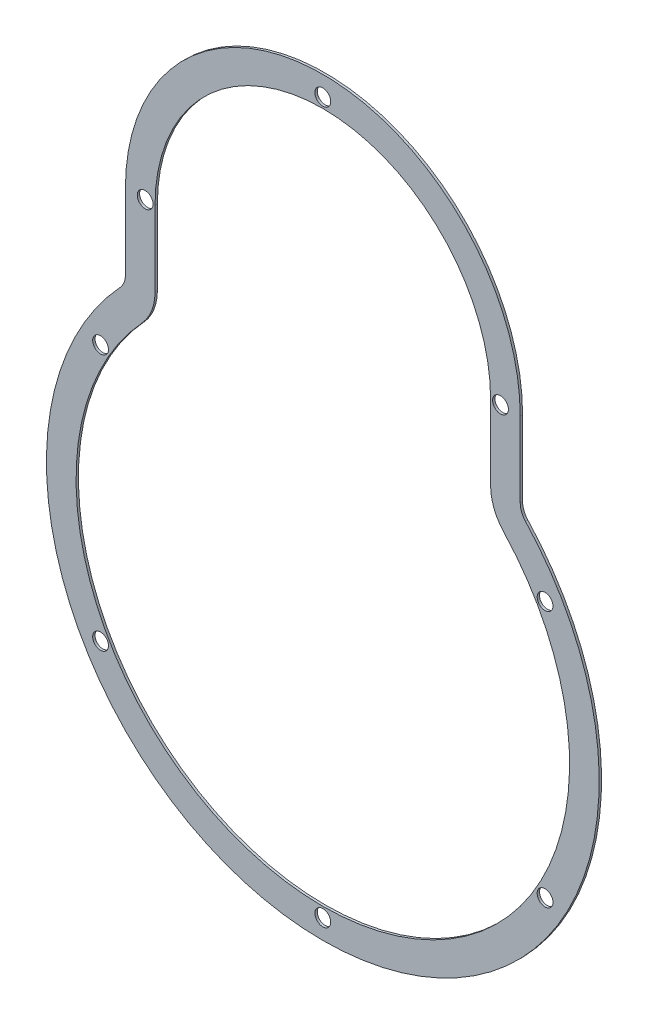
ISO-10303-21;
HEADER;
FILE_DESCRIPTION(('STEP AP214'),'2;1');
FILE_NAME('part.step','',(''),(''),'','','');
FILE_SCHEMA(('AUTOMOTIVE_DESIGN { 1 0 10303 214 1 1 1 1 }'));
ENDSEC;
DATA;
#1=APPLICATION_CONTEXT('core data for automotive mechanical design processes');
#2=APPLICATION_PROTOCOL_DEFINITION('international standard','automotive_design',2000,#1);
#3=PRODUCT_CONTEXT('',#1,'mechanical');
#4=PRODUCT('Part','Part','',(#3));
#5=PRODUCT_RELATED_PRODUCT_CATEGORY('part','',(#4));
#6=PRODUCT_DEFINITION_FORMATION('','',#4);
#7=PRODUCT_DEFINITION_CONTEXT('part definition',#1,'design');
#8=PRODUCT_DEFINITION('design','',#6,#7);
#9=PRODUCT_DEFINITION_SHAPE('','',#8);
#10=(LENGTH_UNIT() NAMED_UNIT(*) SI_UNIT(.MILLI.,.METRE.));
#11=(NAMED_UNIT(*) PLANE_ANGLE_UNIT() SI_UNIT($,.RADIAN.));
#12=(NAMED_UNIT(*) SI_UNIT($,.STERADIAN.) SOLID_ANGLE_UNIT());
#13=UNCERTAINTY_MEASURE_WITH_UNIT(LENGTH_MEASURE(1.E-05),#10,'distance_accuracy_value','');
#14=(GEOMETRIC_REPRESENTATION_CONTEXT(3) GLOBAL_UNCERTAINTY_ASSIGNED_CONTEXT((#13)) GLOBAL_UNIT_ASSIGNED_CONTEXT((#10,
#11,#12)) REPRESENTATION_CONTEXT('',''));
#15=CARTESIAN_POINT('',(0.,0.,0.));
#16=DIRECTION('',(0.,0.,1.));
#17=DIRECTION('',(1.,0.,0.));
#18=AXIS2_PLACEMENT_3D('',#15,#16,#17);
#19=CARTESIAN_POINT('',(0.,88.9,0.762));
#20=DIRECTION('',(0.,0.,1.));
#21=DIRECTION('',(1.,0.,0.));
#22=AXIS2_PLACEMENT_3D('',#19,#20,#21);
#23=PLANE('',#22);
#24=CARTESIAN_POINT('',(71.4903970824055,-41.2749999999998,0.762));
#25=DIRECTION('',(0.,0.,1.));
#26=DIRECTION('',(1.,0.,0.));
#27=AXIS2_PLACEMENT_3D('',#24,#25,#26);
#28=CIRCLE('',#27,2.54);
#29=CARTESIAN_POINT('',(74.0303970824055,-41.2749999999998,0.762));
#30=VERTEX_POINT('',#29);
#31=EDGE_CURVE('E326',#30,#30,#28,.T.);
#32=ORIENTED_EDGE('',*,*,#31,.F.);
#33=EDGE_LOOP('',(#32));
#34=FACE_BOUND('',#33,.T.);
#35=CARTESIAN_POINT('',(57.15,88.9000000000006,0.762));
#36=DIRECTION('',(0.,0.,1.));
#37=DIRECTION('',(1.,0.,0.));
#38=AXIS2_PLACEMENT_3D('',#35,#36,#37);
#39=CIRCLE('',#38,2.54);
#40=CARTESIAN_POINT('',(59.69,88.9000000000006,0.762));
#41=VERTEX_POINT('',#40);
#42=EDGE_CURVE('E338',#41,#41,#39,.T.);
#43=ORIENTED_EDGE('',*,*,#42,.F.);
#44=EDGE_LOOP('',(#43));
#45=FACE_BOUND('',#44,.T.);
#46=CARTESIAN_POINT('',(-57.15,88.8999999999998,0.762));
#47=DIRECTION('',(0.,0.,1.));
#48=DIRECTION('',(1.,0.,0.));
#49=AXIS2_PLACEMENT_3D('',#46,#47,#48);
#50=CIRCLE('',#49,2.54);
#51=CARTESIAN_POINT('',(-54.61,88.8999999999998,0.762));
#52=VERTEX_POINT('',#51);
#53=EDGE_CURVE('E350',#52,#52,#50,.T.);
#54=ORIENTED_EDGE('',*,*,#53,.F.);
#55=EDGE_LOOP('',(#54));
#56=FACE_BOUND('',#55,.T.);
#57=CARTESIAN_POINT('',(-71.4903970824049,-41.2750000000008,0.762));
#58=DIRECTION('',(0.,0.,1.));
#59=DIRECTION('',(1.,0.,0.));
#60=AXIS2_PLACEMENT_3D('',#57,#58,#59);
#61=CIRCLE('',#60,2.54);
#62=CARTESIAN_POINT('',(-68.9503970824049,-41.2750000000008,0.762));
#63=VERTEX_POINT('',#62);
#64=EDGE_CURVE('E158',#63,#63,#61,.T.);
#65=ORIENTED_EDGE('',*,*,#64,.F.);
#66=EDGE_LOOP('',(#65));
#67=FACE_BOUND('',#66,.T.);
#68=CARTESIAN_POINT('',(0.,88.9,0.762));
#69=DIRECTION('',(0.,0.,1.));
#70=DIRECTION('',(1.,0.,0.));
#71=AXIS2_PLACEMENT_3D('',#68,#69,#70);
#72=CIRCLE('',#71,63.5);
#73=CARTESIAN_POINT('',(63.5,88.9,0.762));
#74=VERTEX_POINT('',#73);
#75=CARTESIAN_POINT('',(-63.5,88.9,0.762));
#76=VERTEX_POINT('',#75);
#77=EDGE_CURVE('E178',#74,#76,#72,.T.);
#78=ORIENTED_EDGE('',*,*,#77,.T.);
#79=DIRECTION('',(0.,-1.,0.));
#80=VECTOR('',#79,1.);
#81=CARTESIAN_POINT('',(-63.5,88.9,0.762));
#82=LINE('',#81,#80);
#83=CARTESIAN_POINT('',(-63.5,64.7575478226284,0.762));
#84=VERTEX_POINT('',#83);
#85=EDGE_CURVE('E181',#76,#84,#82,.T.);
#86=ORIENTED_EDGE('',*,*,#85,.T.);
#87=CARTESIAN_POINT('',(-69.85,64.7575478226284,0.762));
#88=DIRECTION('',(0.,0.,-1.));
#89=DIRECTION('',(1.,0.,0.));
#90=AXIS2_PLACEMENT_3D('',#87,#88,#89);
#91=CIRCLE('',#90,6.34999999999999);
#92=CARTESIAN_POINT('',(-65.1933333333333,60.4403779677865,0.762));
#93=VERTEX_POINT('',#92);
#94=EDGE_CURVE('E184',#84,#93,#91,.T.);
#95=ORIENTED_EDGE('',*,*,#94,.T.);
#96=CARTESIAN_POINT('',(0.,0.,0.762));
#97=DIRECTION('',(0.,0.,1.));
#98=DIRECTION('',(1.,0.,0.));
#99=AXIS2_PLACEMENT_3D('',#96,#97,#98);
#100=CIRCLE('',#99,88.9);
#101=CARTESIAN_POINT('',(65.1933333333333,60.4403779677865,0.762));
#102=VERTEX_POINT('',#101);
#103=EDGE_CURVE('E186',#93,#102,#100,.T.);
#104=ORIENTED_EDGE('',*,*,#103,.T.);
#105=CARTESIAN_POINT('',(69.85,64.7575478226284,0.762));
#106=DIRECTION('',(0.,0.,-1.));
#107=DIRECTION('',(1.,0.,0.));
#108=AXIS2_PLACEMENT_3D('',#105,#106,#107);
#109=CIRCLE('',#108,6.35);
#110=CARTESIAN_POINT('',(63.5,64.7575478226284,0.762));
#111=VERTEX_POINT('',#110);
#112=EDGE_CURVE('E188',#102,#111,#109,.T.);
#113=ORIENTED_EDGE('',*,*,#112,.T.);
#114=DIRECTION('',(0.,1.,0.));
#115=VECTOR('',#114,1.);
#116=CARTESIAN_POINT('',(63.5,64.7575478226284,0.762));
#117=LINE('',#116,#115);
#118=EDGE_CURVE('E190',#111,#74,#117,.T.);
#119=ORIENTED_EDGE('',*,*,#118,.T.);
#120=EDGE_LOOP('',(#78,#86,#95,#104,#113,#119));
#121=FACE_BOUND('',#120,.T.);
#122=DIRECTION('',(0.,-1.,0.));
#123=VECTOR('',#122,1.);
#124=CARTESIAN_POINT('',(-53.975,88.9,0.762));
#125=LINE('',#124,#123);
#126=CARTESIAN_POINT('',(-53.975,88.9,0.762));
#127=VERTEX_POINT('',#126);
#128=CARTESIAN_POINT('',(-53.975,64.7575478226284,0.762));
#129=VERTEX_POINT('',#128);
#130=EDGE_CURVE('E132',#127,#129,#125,.T.);
#131=ORIENTED_EDGE('',*,*,#130,.F.);
#132=CARTESIAN_POINT('',(0.,88.9,0.762));
#133=DIRECTION('',(0.,0.,1.));
#134=DIRECTION('',(1.,0.,0.));
#135=AXIS2_PLACEMENT_3D('',#132,#133,#134);
#136=CIRCLE('',#135,53.975);
#137=CARTESIAN_POINT('',(53.975,88.9,0.762));
#138=VERTEX_POINT('',#137);
#139=EDGE_CURVE('E124',#138,#127,#136,.T.);
#140=ORIENTED_EDGE('',*,*,#139,.F.);
#141=DIRECTION('',(0.,1.,0.));
#142=VECTOR('',#141,1.);
#143=CARTESIAN_POINT('',(53.975,64.7575478226284,0.762));
#144=LINE('',#143,#142);
#145=CARTESIAN_POINT('',(53.975,64.7575478226284,0.762));
#146=VERTEX_POINT('',#145);
#147=EDGE_CURVE('E155',#146,#138,#144,.T.);
#148=ORIENTED_EDGE('',*,*,#147,.F.);
#149=CARTESIAN_POINT('',(69.85,64.7575478226284,0.762));
#150=DIRECTION('',(0.,0.,-1.));
#151=DIRECTION('',(1.,0.,0.));
#152=AXIS2_PLACEMENT_3D('',#149,#150,#151);
#153=CIRCLE('',#152,15.875);
#154=CARTESIAN_POINT('',(58.2083333333333,53.9646231855236,0.762));
#155=VERTEX_POINT('',#154);
#156=EDGE_CURVE('E153',#155,#146,#153,.T.);
#157=ORIENTED_EDGE('',*,*,#156,.F.);
#158=CARTESIAN_POINT('',(0.,0.,0.762));
#159=DIRECTION('',(0.,0.,1.));
#160=DIRECTION('',(1.,0.,0.));
#161=AXIS2_PLACEMENT_3D('',#158,#159,#160);
#162=CIRCLE('',#161,79.375);
#163=CARTESIAN_POINT('',(-58.2083333333333,53.9646231855236,0.762));
#164=VERTEX_POINT('',#163);
#165=EDGE_CURVE('E148',#164,#155,#162,.T.);
#166=ORIENTED_EDGE('',*,*,#165,.F.);
#167=CARTESIAN_POINT('',(-69.85,64.7575478226284,0.762));
#168=DIRECTION('',(0.,0.,-1.));
#169=DIRECTION('',(1.,0.,0.));
#170=AXIS2_PLACEMENT_3D('',#167,#168,#169);
#171=CIRCLE('',#170,15.875);
#172=EDGE_CURVE('E146',#129,#164,#171,.T.);
#173=ORIENTED_EDGE('',*,*,#172,.F.);
#174=EDGE_LOOP('',(#131,#140,#148,#157,#166,#173));
#175=FACE_BOUND('',#174,.T.);
#176=CARTESIAN_POINT('',(-71.4903970824058,41.2749999999993,0.762));
#177=DIRECTION('',(0.,0.,1.));
#178=DIRECTION('',(1.,0.,0.));
#179=AXIS2_PLACEMENT_3D('',#176,#177,#178);
#180=CIRCLE('',#179,2.54);
#181=CARTESIAN_POINT('',(-68.9503970824058,41.2749999999993,0.762));
#182=VERTEX_POINT('',#181);
#183=EDGE_CURVE('E356',#182,#182,#180,.T.);
#184=ORIENTED_EDGE('',*,*,#183,.F.);
#185=EDGE_LOOP('',(#184));
#186=FACE_BOUND('',#185,.T.);
#187=CARTESIAN_POINT('',(0.,146.05,0.762));
#188=DIRECTION('',(0.,0.,1.));
#189=DIRECTION('',(1.,0.,0.));
#190=AXIS2_PLACEMENT_3D('',#187,#188,#189);
#191=CIRCLE('',#190,2.54);
#192=CARTESIAN_POINT('',(2.54,146.05,0.762));
#193=VERTEX_POINT('',#192);
#194=EDGE_CURVE('E344',#193,#193,#191,.T.);
#195=ORIENTED_EDGE('',*,*,#194,.F.);
#196=EDGE_LOOP('',(#195));
#197=FACE_BOUND('',#196,.T.);
#198=CARTESIAN_POINT('',(71.4903970824052,41.2750000000003,0.762));
#199=DIRECTION('',(0.,0.,1.));
#200=DIRECTION('',(1.,0.,0.));
#201=AXIS2_PLACEMENT_3D('',#198,#199,#200);
#202=CIRCLE('',#201,2.54);
#203=CARTESIAN_POINT('',(74.0303970824052,41.2750000000003,0.762));
#204=VERTEX_POINT('',#203);
#205=EDGE_CURVE('E332',#204,#204,#202,.T.);
#206=ORIENTED_EDGE('',*,*,#205,.F.);
#207=EDGE_LOOP('',(#206));
#208=FACE_BOUND('',#207,.T.);
#209=CARTESIAN_POINT('',(0.,-82.55,0.762));
#210=DIRECTION('',(0.,0.,1.));
#211=DIRECTION('',(1.,0.,0.));
#212=AXIS2_PLACEMENT_3D('',#209,#210,#211);
#213=CIRCLE('',#212,2.54);
#214=CARTESIAN_POINT('',(2.54,-82.55,0.762));
#215=VERTEX_POINT('',#214);
#216=EDGE_CURVE('E317',#215,#215,#213,.T.);
#217=ORIENTED_EDGE('',*,*,#216,.F.);
#218=EDGE_LOOP('',(#217));
#219=FACE_BOUND('',#218,.T.);
#220=ADVANCED_FACE('F35',(#34,#45,#56,#67,#121,#175,#186,#197,#208,#219),#23,.T.);
#221=CARTESIAN_POINT('',(0.,88.9,0.));
#222=DIRECTION('',(0.,0.,1.));
#223=DIRECTION('',(1.,0.,0.));
#224=AXIS2_PLACEMENT_3D('',#221,#222,#223);
#225=PLANE('',#224);
#226=CARTESIAN_POINT('',(0.,88.9,0.));
#227=DIRECTION('',(0.,0.,1.));
#228=DIRECTION('',(1.,0.,0.));
#229=AXIS2_PLACEMENT_3D('',#226,#227,#228);
#230=CIRCLE('',#229,63.5);
#231=CARTESIAN_POINT('',(63.5,88.9,0.));
#232=VERTEX_POINT('',#231);
#233=CARTESIAN_POINT('',(-63.5,88.9,0.));
#234=VERTEX_POINT('',#233);
#235=EDGE_CURVE('E140',#232,#234,#230,.T.);
#236=ORIENTED_EDGE('',*,*,#235,.F.);
#237=DIRECTION('',(0.,1.,0.));
#238=VECTOR('',#237,1.);
#239=CARTESIAN_POINT('',(63.5,64.7575478226284,0.));
#240=LINE('',#239,#238);
#241=CARTESIAN_POINT('',(63.5,64.7575478226284,0.));
#242=VERTEX_POINT('',#241);
#243=EDGE_CURVE('E182',#242,#232,#240,.T.);
#244=ORIENTED_EDGE('',*,*,#243,.F.);
#245=CARTESIAN_POINT('',(69.85,64.7575478226284,0.));
#246=DIRECTION('',(0.,0.,-1.));
#247=DIRECTION('',(1.,0.,0.));
#248=AXIS2_PLACEMENT_3D('',#245,#246,#247);
#249=CIRCLE('',#248,6.35);
#250=CARTESIAN_POINT('',(65.1933333333333,60.4403779677865,0.));
#251=VERTEX_POINT('',#250);
#252=EDGE_CURVE('E201',#251,#242,#249,.T.);
#253=ORIENTED_EDGE('',*,*,#252,.F.);
#254=CARTESIAN_POINT('',(0.,0.,0.));
#255=DIRECTION('',(0.,0.,1.));
#256=DIRECTION('',(1.,0.,0.));
#257=AXIS2_PLACEMENT_3D('',#254,#255,#256);
#258=CIRCLE('',#257,88.9);
#259=CARTESIAN_POINT('',(-65.1933333333333,60.4403779677865,0.));
#260=VERTEX_POINT('',#259);
#261=EDGE_CURVE('E199',#260,#251,#258,.T.);
#262=ORIENTED_EDGE('',*,*,#261,.F.);
#263=CARTESIAN_POINT('',(-69.85,64.7575478226284,0.));
#264=DIRECTION('',(0.,0.,-1.));
#265=DIRECTION('',(1.,0.,0.));
#266=AXIS2_PLACEMENT_3D('',#263,#264,#265);
#267=CIRCLE('',#266,6.34999999999999);
#268=CARTESIAN_POINT('',(-63.5,64.7575478226284,0.));
#269=VERTEX_POINT('',#268);
#270=EDGE_CURVE('E197',#269,#260,#267,.T.);
#271=ORIENTED_EDGE('',*,*,#270,.F.);
#272=DIRECTION('',(0.,-1.,0.));
#273=VECTOR('',#272,1.);
#274=CARTESIAN_POINT('',(-63.5,88.9,0.));
#275=LINE('',#274,#273);
#276=EDGE_CURVE('E195',#234,#269,#275,.T.);
#277=ORIENTED_EDGE('',*,*,#276,.F.);
#278=EDGE_LOOP('',(#236,#244,#253,#262,#271,#277));
#279=FACE_BOUND('',#278,.T.);
#280=CARTESIAN_POINT('',(0.,88.9,0.));
#281=DIRECTION('',(0.,0.,1.));
#282=DIRECTION('',(1.,0.,0.));
#283=AXIS2_PLACEMENT_3D('',#280,#281,#282);
#284=CIRCLE('',#283,53.975);
#285=CARTESIAN_POINT('',(53.975,88.9,0.));
#286=VERTEX_POINT('',#285);
#287=CARTESIAN_POINT('',(-53.975,88.9,0.));
#288=VERTEX_POINT('',#287);
#289=EDGE_CURVE('E58',#286,#288,#284,.T.);
#290=ORIENTED_EDGE('',*,*,#289,.T.);
#291=DIRECTION('',(0.,-1.,0.));
#292=VECTOR('',#291,1.);
#293=CARTESIAN_POINT('',(-53.975,88.9,0.));
#294=LINE('',#293,#292);
#295=CARTESIAN_POINT('',(-53.975,64.7575478226284,0.));
#296=VERTEX_POINT('',#295);
#297=EDGE_CURVE('E139',#288,#296,#294,.T.);
#298=ORIENTED_EDGE('',*,*,#297,.T.);
#299=CARTESIAN_POINT('',(-69.85,64.7575478226284,0.));
#300=DIRECTION('',(0.,0.,-1.));
#301=DIRECTION('',(1.,0.,0.));
#302=AXIS2_PLACEMENT_3D('',#299,#300,#301);
#303=CIRCLE('',#302,15.875);
#304=CARTESIAN_POINT('',(-58.2083333333333,53.9646231855236,0.));
#305=VERTEX_POINT('',#304);
#306=EDGE_CURVE('E160',#296,#305,#303,.T.);
#307=ORIENTED_EDGE('',*,*,#306,.T.);
#308=CARTESIAN_POINT('',(0.,0.,0.));
#309=DIRECTION('',(0.,0.,1.));
#310=DIRECTION('',(1.,0.,0.));
#311=AXIS2_PLACEMENT_3D('',#308,#309,#310);
#312=CIRCLE('',#311,79.375);
#313=CARTESIAN_POINT('',(58.2083333333333,53.9646231855236,0.));
#314=VERTEX_POINT('',#313);
#315=EDGE_CURVE('E163',#305,#314,#312,.T.);
#316=ORIENTED_EDGE('',*,*,#315,.T.);
#317=CARTESIAN_POINT('',(69.85,64.7575478226284,0.));
#318=DIRECTION('',(0.,0.,-1.));
#319=DIRECTION('',(1.,0.,0.));
#320=AXIS2_PLACEMENT_3D('',#317,#318,#319);
#321=CIRCLE('',#320,15.875);
#322=CARTESIAN_POINT('',(53.975,64.7575478226284,0.));
#323=VERTEX_POINT('',#322);
#324=EDGE_CURVE('E166',#314,#323,#321,.T.);
#325=ORIENTED_EDGE('',*,*,#324,.T.);
#326=DIRECTION('',(0.,1.,0.));
#327=VECTOR('',#326,1.);
#328=CARTESIAN_POINT('',(53.975,64.7575478226284,0.));
#329=LINE('',#328,#327);
#330=EDGE_CURVE('E133',#323,#286,#329,.T.);
#331=ORIENTED_EDGE('',*,*,#330,.T.);
#332=EDGE_LOOP('',(#290,#298,#307,#316,#325,#331));
#333=FACE_BOUND('',#332,.T.);
#334=CARTESIAN_POINT('',(-71.4903970824049,-41.2750000000008,0.));
#335=DIRECTION('',(0.,0.,1.));
#336=DIRECTION('',(1.,0.,0.));
#337=AXIS2_PLACEMENT_3D('',#334,#335,#336);
#338=CIRCLE('',#337,2.54);
#339=CARTESIAN_POINT('',(-68.9503970824049,-41.2750000000008,0.));
#340=VERTEX_POINT('',#339);
#341=EDGE_CURVE('E359',#340,#340,#338,.T.);
#342=ORIENTED_EDGE('',*,*,#341,.T.);
#343=EDGE_LOOP('',(#342));
#344=FACE_BOUND('',#343,.T.);
#345=CARTESIAN_POINT('',(-71.4903970824058,41.2749999999993,0.));
#346=DIRECTION('',(0.,0.,1.));
#347=DIRECTION('',(1.,0.,0.));
#348=AXIS2_PLACEMENT_3D('',#345,#346,#347);
#349=CIRCLE('',#348,2.54);
#350=CARTESIAN_POINT('',(-68.9503970824058,41.2749999999993,0.));
#351=VERTEX_POINT('',#350);
#352=EDGE_CURVE('E353',#351,#351,#349,.T.);
#353=ORIENTED_EDGE('',*,*,#352,.T.);
#354=EDGE_LOOP('',(#353));
#355=FACE_BOUND('',#354,.T.);
#356=CARTESIAN_POINT('',(-57.15,88.8999999999998,0.));
#357=DIRECTION('',(0.,0.,1.));
#358=DIRECTION('',(1.,0.,0.));
#359=AXIS2_PLACEMENT_3D('',#356,#357,#358);
#360=CIRCLE('',#359,2.54);
#361=CARTESIAN_POINT('',(-54.61,88.8999999999998,0.));
#362=VERTEX_POINT('',#361);
#363=EDGE_CURVE('E347',#362,#362,#360,.T.);
#364=ORIENTED_EDGE('',*,*,#363,.T.);
#365=EDGE_LOOP('',(#364));
#366=FACE_BOUND('',#365,.T.);
#367=CARTESIAN_POINT('',(0.,146.05,0.));
#368=DIRECTION('',(0.,0.,1.));
#369=DIRECTION('',(1.,0.,0.));
#370=AXIS2_PLACEMENT_3D('',#367,#368,#369);
#371=CIRCLE('',#370,2.54);
#372=CARTESIAN_POINT('',(2.54,146.05,0.));
#373=VERTEX_POINT('',#372);
#374=EDGE_CURVE('E341',#373,#373,#371,.T.);
#375=ORIENTED_EDGE('',*,*,#374,.T.);
#376=EDGE_LOOP('',(#375));
#377=FACE_BOUND('',#376,.T.);
#378=CARTESIAN_POINT('',(57.15,88.9000000000006,0.));
#379=DIRECTION('',(0.,0.,1.));
#380=DIRECTION('',(1.,0.,0.));
#381=AXIS2_PLACEMENT_3D('',#378,#379,#380);
#382=CIRCLE('',#381,2.54);
#383=CARTESIAN_POINT('',(59.69,88.9000000000006,0.));
#384=VERTEX_POINT('',#383);
#385=EDGE_CURVE('E335',#384,#384,#382,.T.);
#386=ORIENTED_EDGE('',*,*,#385,.T.);
#387=EDGE_LOOP('',(#386));
#388=FACE_BOUND('',#387,.T.);
#389=CARTESIAN_POINT('',(71.4903970824052,41.2750000000003,0.));
#390=DIRECTION('',(0.,0.,1.));
#391=DIRECTION('',(1.,0.,0.));
#392=AXIS2_PLACEMENT_3D('',#389,#390,#391);
#393=CIRCLE('',#392,2.54);
#394=CARTESIAN_POINT('',(74.0303970824052,41.2750000000003,0.));
#395=VERTEX_POINT('',#394);
#396=EDGE_CURVE('E329',#395,#395,#393,.T.);
#397=ORIENTED_EDGE('',*,*,#396,.T.);
#398=EDGE_LOOP('',(#397));
#399=FACE_BOUND('',#398,.T.);
#400=CARTESIAN_POINT('',(71.4903970824055,-41.2749999999998,0.));
#401=DIRECTION('',(0.,0.,1.));
#402=DIRECTION('',(1.,0.,0.));
#403=AXIS2_PLACEMENT_3D('',#400,#401,#402);
#404=CIRCLE('',#403,2.54);
#405=CARTESIAN_POINT('',(74.0303970824055,-41.2749999999998,0.));
#406=VERTEX_POINT('',#405);
#407=EDGE_CURVE('E323',#406,#406,#404,.T.);
#408=ORIENTED_EDGE('',*,*,#407,.T.);
#409=EDGE_LOOP('',(#408));
#410=FACE_BOUND('',#409,.T.);
#411=CARTESIAN_POINT('',(0.,-82.55,0.));
#412=DIRECTION('',(0.,0.,1.));
#413=DIRECTION('',(1.,0.,0.));
#414=AXIS2_PLACEMENT_3D('',#411,#412,#413);
#415=CIRCLE('',#414,2.54);
#416=CARTESIAN_POINT('',(2.54,-82.55,0.));
#417=VERTEX_POINT('',#416);
#418=EDGE_CURVE('E320',#417,#417,#415,.T.);
#419=ORIENTED_EDGE('',*,*,#418,.T.);
#420=EDGE_LOOP('',(#419));
#421=FACE_BOUND('',#420,.T.);
#422=ADVANCED_FACE('F225',(#279,#333,#344,#355,#366,#377,#388,#399,#410,#421),#225,.F.);
#423=CARTESIAN_POINT('',(0.,88.9,0.762));
#424=DIRECTION('',(0.,0.,-1.));
#425=DIRECTION('',(-1.,0.,0.));
#426=AXIS2_PLACEMENT_3D('',#423,#424,#425);
#427=CYLINDRICAL_SURFACE('',#426,63.5);
#428=ORIENTED_EDGE('',*,*,#235,.T.);
#429=DIRECTION('',(0.,0.,-1.));
#430=VECTOR('',#429,1.);
#431=CARTESIAN_POINT('',(-63.5,88.9,0.762));
#432=LINE('',#431,#430);
#433=EDGE_CURVE('E11',#76,#234,#432,.T.);
#434=ORIENTED_EDGE('',*,*,#433,.F.);
#435=ORIENTED_EDGE('',*,*,#77,.F.);
#436=DIRECTION('',(0.,0.,-1.));
#437=VECTOR('',#436,1.);
#438=CARTESIAN_POINT('',(63.5,88.9,0.762));
#439=LINE('',#438,#437);
#440=EDGE_CURVE('E192',#74,#232,#439,.T.);
#441=ORIENTED_EDGE('',*,*,#440,.T.);
#442=EDGE_LOOP('',(#428,#434,#435,#441));
#443=FACE_BOUND('',#442,.T.);
#444=ADVANCED_FACE('F37',(#443),#427,.T.);
#445=CARTESIAN_POINT('',(-63.5,88.9,0.762));
#446=DIRECTION('',(1.,0.,0.));
#447=DIRECTION('',(0.,0.,-1.));
#448=AXIS2_PLACEMENT_3D('',#445,#446,#447);
#449=PLANE('',#448);
#450=ORIENTED_EDGE('',*,*,#276,.T.);
#451=DIRECTION('',(0.,0.,-1.));
#452=VECTOR('',#451,1.);
#453=CARTESIAN_POINT('',(-63.5,64.7575478226284,0.762));
#454=LINE('',#453,#452);
#455=EDGE_CURVE('E43',#84,#269,#454,.T.);
#456=ORIENTED_EDGE('',*,*,#455,.F.);
#457=ORIENTED_EDGE('',*,*,#85,.F.);
#458=ORIENTED_EDGE('',*,*,#433,.T.);
#459=EDGE_LOOP('',(#450,#456,#457,#458));
#460=FACE_BOUND('',#459,.T.);
#461=ADVANCED_FACE('F242',(#460),#449,.F.);
#462=CARTESIAN_POINT('',(-69.85,64.7575478226284,0.762));
#463=DIRECTION('',(0.,0.,-1.));
#464=DIRECTION('',(-1.,0.,0.));
#465=AXIS2_PLACEMENT_3D('',#462,#463,#464);
#466=CYLINDRICAL_SURFACE('',#465,6.34999999999999);
#467=ORIENTED_EDGE('',*,*,#270,.T.);
#468=DIRECTION('',(0.,0.,-1.));
#469=VECTOR('',#468,1.);
#470=CARTESIAN_POINT('',(-65.1933333333333,60.4403779677865,0.762));
#471=LINE('',#470,#469);
#472=EDGE_CURVE('E212',#93,#260,#471,.T.);
#473=ORIENTED_EDGE('',*,*,#472,.F.);
#474=ORIENTED_EDGE('',*,*,#94,.F.);
#475=ORIENTED_EDGE('',*,*,#455,.T.);
#476=EDGE_LOOP('',(#467,#473,#474,#475));
#477=FACE_BOUND('',#476,.T.);
#478=ADVANCED_FACE('F219',(#477),#466,.F.);
#479=CARTESIAN_POINT('',(0.,0.,0.762));
#480=DIRECTION('',(0.,0.,-1.));
#481=DIRECTION('',(-1.,0.,0.));
#482=AXIS2_PLACEMENT_3D('',#479,#480,#481);
#483=CYLINDRICAL_SURFACE('',#482,88.9);
#484=ORIENTED_EDGE('',*,*,#261,.T.);
#485=DIRECTION('',(0.,0.,-1.));
#486=VECTOR('',#485,1.);
#487=CARTESIAN_POINT('',(65.1933333333333,60.4403779677865,0.762));
#488=LINE('',#487,#486);
#489=EDGE_CURVE('E209',#102,#251,#488,.T.);
#490=ORIENTED_EDGE('',*,*,#489,.F.);
#491=ORIENTED_EDGE('',*,*,#103,.F.);
#492=ORIENTED_EDGE('',*,*,#472,.T.);
#493=EDGE_LOOP('',(#484,#490,#491,#492));
#494=FACE_BOUND('',#493,.T.);
#495=ADVANCED_FACE('F231',(#494),#483,.T.);
#496=CARTESIAN_POINT('',(69.85,64.7575478226284,0.762));
#497=DIRECTION('',(0.,0.,-1.));
#498=DIRECTION('',(-1.,0.,0.));
#499=AXIS2_PLACEMENT_3D('',#496,#497,#498);
#500=CYLINDRICAL_SURFACE('',#499,6.35);
#501=ORIENTED_EDGE('',*,*,#252,.T.);
#502=DIRECTION('',(0.,0.,-1.));
#503=VECTOR('',#502,1.);
#504=CARTESIAN_POINT('',(63.5,64.7575478226284,0.762));
#505=LINE('',#504,#503);
#506=EDGE_CURVE('E206',#111,#242,#505,.T.);
#507=ORIENTED_EDGE('',*,*,#506,.F.);
#508=ORIENTED_EDGE('',*,*,#112,.F.);
#509=ORIENTED_EDGE('',*,*,#489,.T.);
#510=EDGE_LOOP('',(#501,#507,#508,#509));
#511=FACE_BOUND('',#510,.T.);
#512=ADVANCED_FACE('F235',(#511),#500,.F.);
#513=CARTESIAN_POINT('',(63.5,64.7575478226284,0.762));
#514=DIRECTION('',(-1.,0.,0.));
#515=DIRECTION('',(0.,0.,1.));
#516=AXIS2_PLACEMENT_3D('',#513,#514,#515);
#517=PLANE('',#516);
#518=ORIENTED_EDGE('',*,*,#243,.T.);
#519=ORIENTED_EDGE('',*,*,#440,.F.);
#520=ORIENTED_EDGE('',*,*,#118,.F.);
#521=ORIENTED_EDGE('',*,*,#506,.T.);
#522=EDGE_LOOP('',(#518,#519,#520,#521));
#523=FACE_BOUND('',#522,.T.);
#524=ADVANCED_FACE('F245',(#523),#517,.F.);
#525=CARTESIAN_POINT('',(0.,88.9,0.762));
#526=DIRECTION('',(0.,0.,-1.));
#527=DIRECTION('',(-1.,0.,0.));
#528=AXIS2_PLACEMENT_3D('',#525,#526,#527);
#529=CYLINDRICAL_SURFACE('',#528,53.975);
#530=ORIENTED_EDGE('',*,*,#289,.F.);
#531=DIRECTION('',(0.,0.,-1.));
#532=VECTOR('',#531,1.);
#533=CARTESIAN_POINT('',(53.975,88.9,0.762));
#534=LINE('',#533,#532);
#535=EDGE_CURVE('E128',#138,#286,#534,.T.);
#536=ORIENTED_EDGE('',*,*,#535,.F.);
#537=ORIENTED_EDGE('',*,*,#139,.T.);
#538=DIRECTION('',(0.,0.,-1.));
#539=VECTOR('',#538,1.);
#540=CARTESIAN_POINT('',(-53.975,88.9,0.762));
#541=LINE('',#540,#539);
#542=EDGE_CURVE('E127',#127,#288,#541,.T.);
#543=ORIENTED_EDGE('',*,*,#542,.T.);
#544=EDGE_LOOP('',(#530,#536,#537,#543));
#545=FACE_BOUND('',#544,.T.);
#546=ADVANCED_FACE('F126',(#545),#529,.F.);
#547=CARTESIAN_POINT('',(-53.975,88.9,0.762));
#548=DIRECTION('',(1.,0.,0.));
#549=DIRECTION('',(0.,0.,-1.));
#550=AXIS2_PLACEMENT_3D('',#547,#548,#549);
#551=PLANE('',#550);
#552=ORIENTED_EDGE('',*,*,#297,.F.);
#553=ORIENTED_EDGE('',*,*,#542,.F.);
#554=ORIENTED_EDGE('',*,*,#130,.T.);
#555=DIRECTION('',(0.,0.,-1.));
#556=VECTOR('',#555,1.);
#557=CARTESIAN_POINT('',(-53.975,64.7575478226284,0.762));
#558=LINE('',#557,#556);
#559=EDGE_CURVE('E141',#129,#296,#558,.T.);
#560=ORIENTED_EDGE('',*,*,#559,.T.);
#561=EDGE_LOOP('',(#552,#553,#554,#560));
#562=FACE_BOUND('',#561,.T.);
#563=ADVANCED_FACE('F136',(#562),#551,.T.);
#564=CARTESIAN_POINT('',(-69.85,64.7575478226284,0.762));
#565=DIRECTION('',(0.,0.,-1.));
#566=DIRECTION('',(-1.,0.,0.));
#567=AXIS2_PLACEMENT_3D('',#564,#565,#566);
#568=CYLINDRICAL_SURFACE('',#567,15.875);
#569=ORIENTED_EDGE('',*,*,#306,.F.);
#570=ORIENTED_EDGE('',*,*,#559,.F.);
#571=ORIENTED_EDGE('',*,*,#172,.T.);
#572=DIRECTION('',(0.,0.,-1.));
#573=VECTOR('',#572,1.);
#574=CARTESIAN_POINT('',(-58.2083333333333,53.9646231855236,0.762));
#575=LINE('',#574,#573);
#576=EDGE_CURVE('E175',#164,#305,#575,.T.);
#577=ORIENTED_EDGE('',*,*,#576,.T.);
#578=EDGE_LOOP('',(#569,#570,#571,#577));
#579=FACE_BOUND('',#578,.T.);
#580=ADVANCED_FACE('F266',(#579),#568,.T.);
#581=CARTESIAN_POINT('',(0.,0.,0.762));
#582=DIRECTION('',(0.,0.,-1.));
#583=DIRECTION('',(-1.,0.,0.));
#584=AXIS2_PLACEMENT_3D('',#581,#582,#583);
#585=CYLINDRICAL_SURFACE('',#584,79.375);
#586=ORIENTED_EDGE('',*,*,#315,.F.);
#587=ORIENTED_EDGE('',*,*,#576,.F.);
#588=ORIENTED_EDGE('',*,*,#165,.T.);
#589=DIRECTION('',(0.,0.,-1.));
#590=VECTOR('',#589,1.);
#591=CARTESIAN_POINT('',(58.2083333333333,53.9646231855236,0.762));
#592=LINE('',#591,#590);
#593=EDGE_CURVE('E173',#155,#314,#592,.T.);
#594=ORIENTED_EDGE('',*,*,#593,.T.);
#595=EDGE_LOOP('',(#586,#587,#588,#594));
#596=FACE_BOUND('',#595,.T.);
#597=ADVANCED_FACE('F269',(#596),#585,.F.);
#598=CARTESIAN_POINT('',(69.85,64.7575478226284,0.762));
#599=DIRECTION('',(0.,0.,-1.));
#600=DIRECTION('',(-1.,0.,0.));
#601=AXIS2_PLACEMENT_3D('',#598,#599,#600);
#602=CYLINDRICAL_SURFACE('',#601,15.875);
#603=ORIENTED_EDGE('',*,*,#324,.F.);
#604=ORIENTED_EDGE('',*,*,#593,.F.);
#605=ORIENTED_EDGE('',*,*,#156,.T.);
#606=DIRECTION('',(0.,0.,-1.));
#607=VECTOR('',#606,1.);
#608=CARTESIAN_POINT('',(53.975,64.7575478226284,0.762));
#609=LINE('',#608,#607);
#610=EDGE_CURVE('E50',#146,#323,#609,.T.);
#611=ORIENTED_EDGE('',*,*,#610,.T.);
#612=EDGE_LOOP('',(#603,#604,#605,#611));
#613=FACE_BOUND('',#612,.T.);
#614=ADVANCED_FACE('F273',(#613),#602,.T.);
#615=CARTESIAN_POINT('',(53.975,64.7575478226284,0.762));
#616=DIRECTION('',(-1.,0.,0.));
#617=DIRECTION('',(0.,0.,1.));
#618=AXIS2_PLACEMENT_3D('',#615,#616,#617);
#619=PLANE('',#618);
#620=ORIENTED_EDGE('',*,*,#330,.F.);
#621=ORIENTED_EDGE('',*,*,#610,.F.);
#622=ORIENTED_EDGE('',*,*,#147,.T.);
#623=ORIENTED_EDGE('',*,*,#535,.T.);
#624=EDGE_LOOP('',(#620,#621,#622,#623));
#625=FACE_BOUND('',#624,.T.);
#626=ADVANCED_FACE('F277',(#625),#619,.T.);
#627=CARTESIAN_POINT('',(-71.4903970824049,-41.2750000000008,0.762));
#628=DIRECTION('',(0.,0.,-1.));
#629=DIRECTION('',(-1.,0.,0.));
#630=AXIS2_PLACEMENT_3D('',#627,#628,#629);
#631=CYLINDRICAL_SURFACE('',#630,2.54);
#632=ORIENTED_EDGE('',*,*,#64,.T.);
#633=EDGE_LOOP('',(#632));
#634=FACE_BOUND('',#633,.T.);
#635=ORIENTED_EDGE('',*,*,#341,.F.);
#636=EDGE_LOOP('',(#635));
#637=FACE_BOUND('',#636,.T.);
#638=ADVANCED_FACE('F281',(#634,#637),#631,.F.);
#639=CARTESIAN_POINT('',(-71.4903970824058,41.2749999999993,0.762));
#640=DIRECTION('',(0.,0.,-1.));
#641=DIRECTION('',(-1.,0.,0.));
#642=AXIS2_PLACEMENT_3D('',#639,#640,#641);
#643=CYLINDRICAL_SURFACE('',#642,2.54);
#644=ORIENTED_EDGE('',*,*,#183,.T.);
#645=EDGE_LOOP('',(#644));
#646=FACE_BOUND('',#645,.T.);
#647=ORIENTED_EDGE('',*,*,#352,.F.);
#648=EDGE_LOOP('',(#647));
#649=FACE_BOUND('',#648,.T.);
#650=ADVANCED_FACE('F284',(#646,#649),#643,.F.);
#651=CARTESIAN_POINT('',(-57.15,88.8999999999998,0.762));
#652=DIRECTION('',(0.,0.,-1.));
#653=DIRECTION('',(-1.,0.,0.));
#654=AXIS2_PLACEMENT_3D('',#651,#652,#653);
#655=CYLINDRICAL_SURFACE('',#654,2.54);
#656=ORIENTED_EDGE('',*,*,#53,.T.);
#657=EDGE_LOOP('',(#656));
#658=FACE_BOUND('',#657,.T.);
#659=ORIENTED_EDGE('',*,*,#363,.F.);
#660=EDGE_LOOP('',(#659));
#661=FACE_BOUND('',#660,.T.);
#662=ADVANCED_FACE('F288',(#658,#661),#655,.F.);
#663=CARTESIAN_POINT('',(0.,146.05,0.762));
#664=DIRECTION('',(0.,0.,-1.));
#665=DIRECTION('',(-1.,0.,0.));
#666=AXIS2_PLACEMENT_3D('',#663,#664,#665);
#667=CYLINDRICAL_SURFACE('',#666,2.54);
#668=ORIENTED_EDGE('',*,*,#194,.T.);
#669=EDGE_LOOP('',(#668));
#670=FACE_BOUND('',#669,.T.);
#671=ORIENTED_EDGE('',*,*,#374,.F.);
#672=EDGE_LOOP('',(#671));
#673=FACE_BOUND('',#672,.T.);
#674=ADVANCED_FACE('F292',(#670,#673),#667,.F.);
#675=CARTESIAN_POINT('',(57.15,88.9000000000006,0.762));
#676=DIRECTION('',(0.,0.,-1.));
#677=DIRECTION('',(-1.,0.,0.));
#678=AXIS2_PLACEMENT_3D('',#675,#676,#677);
#679=CYLINDRICAL_SURFACE('',#678,2.54);
#680=ORIENTED_EDGE('',*,*,#42,.T.);
#681=EDGE_LOOP('',(#680));
#682=FACE_BOUND('',#681,.T.);
#683=ORIENTED_EDGE('',*,*,#385,.F.);
#684=EDGE_LOOP('',(#683));
#685=FACE_BOUND('',#684,.T.);
#686=ADVANCED_FACE('F296',(#682,#685),#679,.F.);
#687=CARTESIAN_POINT('',(71.4903970824052,41.2750000000003,0.762));
#688=DIRECTION('',(0.,0.,-1.));
#689=DIRECTION('',(-1.,0.,0.));
#690=AXIS2_PLACEMENT_3D('',#687,#688,#689);
#691=CYLINDRICAL_SURFACE('',#690,2.54);
#692=ORIENTED_EDGE('',*,*,#205,.T.);
#693=EDGE_LOOP('',(#692));
#694=FACE_BOUND('',#693,.T.);
#695=ORIENTED_EDGE('',*,*,#396,.F.);
#696=EDGE_LOOP('',(#695));
#697=FACE_BOUND('',#696,.T.);
#698=ADVANCED_FACE('F300',(#694,#697),#691,.F.);
#699=CARTESIAN_POINT('',(71.4903970824055,-41.2749999999998,0.762));
#700=DIRECTION('',(0.,0.,-1.));
#701=DIRECTION('',(-1.,0.,0.));
#702=AXIS2_PLACEMENT_3D('',#699,#700,#701);
#703=CYLINDRICAL_SURFACE('',#702,2.54);
#704=ORIENTED_EDGE('',*,*,#31,.T.);
#705=EDGE_LOOP('',(#704));
#706=FACE_BOUND('',#705,.T.);
#707=ORIENTED_EDGE('',*,*,#407,.F.);
#708=EDGE_LOOP('',(#707));
#709=FACE_BOUND('',#708,.T.);
#710=ADVANCED_FACE('F304',(#706,#709),#703,.F.);
#711=CARTESIAN_POINT('',(0.,-82.55,0.762));
#712=DIRECTION('',(0.,0.,-1.));
#713=DIRECTION('',(-1.,0.,0.));
#714=AXIS2_PLACEMENT_3D('',#711,#712,#713);
#715=CYLINDRICAL_SURFACE('',#714,2.54);
#716=ORIENTED_EDGE('',*,*,#216,.T.);
#717=EDGE_LOOP('',(#716));
#718=FACE_BOUND('',#717,.T.);
#719=ORIENTED_EDGE('',*,*,#418,.F.);
#720=EDGE_LOOP('',(#719));
#721=FACE_BOUND('',#720,.T.);
#722=ADVANCED_FACE('F308',(#718,#721),#715,.F.);
#723=CLOSED_SHELL('',(#220,#422,#444,#461,#478,#495,#512,#524,#546,#563,#580,#597,#614,#626,
#638,#650,#662,#674,#686,#698,#710,#722));
#724=MANIFOLD_SOLID_BREP('B2',#723);
#725=ADVANCED_BREP_SHAPE_REPRESENTATION('',(#18,#724),#14);
#726=SHAPE_DEFINITION_REPRESENTATION(#9,#725);
ENDSEC;
END-ISO-10303-21;
